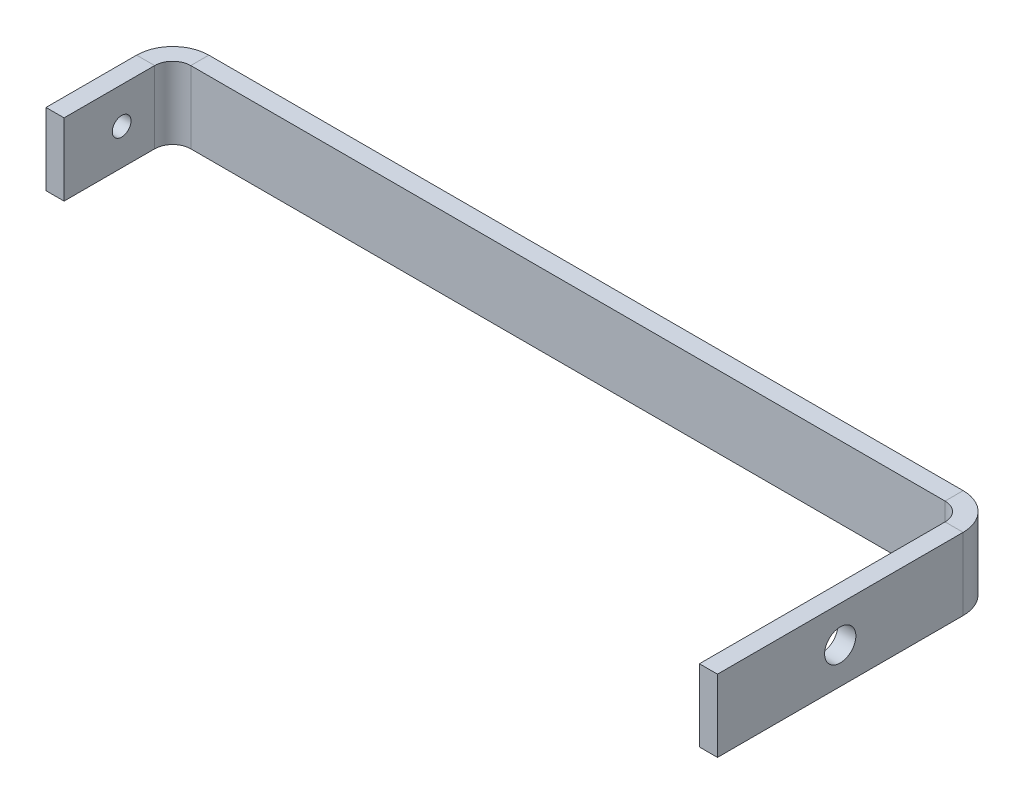
ISO-10303-21;
HEADER;
FILE_DESCRIPTION(('STEP AP214'),'2;1');
FILE_NAME('part.step','',(''),(''),'','','');
FILE_SCHEMA(('AUTOMOTIVE_DESIGN { 1 0 10303 214 1 1 1 1 }'));
ENDSEC;
DATA;
#1=APPLICATION_CONTEXT('core data for automotive mechanical design processes');
#2=APPLICATION_PROTOCOL_DEFINITION('international standard','automotive_design',2000,#1);
#3=PRODUCT_CONTEXT('',#1,'mechanical');
#4=PRODUCT('Part','Part','',(#3));
#5=PRODUCT_RELATED_PRODUCT_CATEGORY('part','',(#4));
#6=PRODUCT_DEFINITION_FORMATION('','',#4);
#7=PRODUCT_DEFINITION_CONTEXT('part definition',#1,'design');
#8=PRODUCT_DEFINITION('design','',#6,#7);
#9=PRODUCT_DEFINITION_SHAPE('','',#8);
#10=(LENGTH_UNIT() NAMED_UNIT(*) SI_UNIT(.MILLI.,.METRE.));
#11=(NAMED_UNIT(*) PLANE_ANGLE_UNIT() SI_UNIT($,.RADIAN.));
#12=(NAMED_UNIT(*) SI_UNIT($,.STERADIAN.) SOLID_ANGLE_UNIT());
#13=UNCERTAINTY_MEASURE_WITH_UNIT(LENGTH_MEASURE(1.E-05),#10,'distance_accuracy_value','');
#14=(GEOMETRIC_REPRESENTATION_CONTEXT(3) GLOBAL_UNCERTAINTY_ASSIGNED_CONTEXT((#13)) GLOBAL_UNIT_ASSIGNED_CONTEXT((#10,
#11,#12)) REPRESENTATION_CONTEXT('',''));
#15=CARTESIAN_POINT('',(0.,0.,0.));
#16=DIRECTION('',(0.,0.,1.));
#17=DIRECTION('',(1.,0.,0.));
#18=AXIS2_PLACEMENT_3D('',#15,#16,#17);
#19=CARTESIAN_POINT('',(0.,0.,-3.18));
#20=DIRECTION('',(0.,0.,-1.));
#21=DIRECTION('',(-1.,0.,0.));
#22=AXIS2_PLACEMENT_3D('',#19,#20,#21);
#23=PLANE('',#22);
#24=DIRECTION('',(1.,0.,0.));
#25=VECTOR('',#24,1.);
#26=CARTESIAN_POINT('',(103.5,-6.34999999999999,-3.18));
#27=LINE('',#26,#25);
#28=CARTESIAN_POINT('',(-80.0566,-6.35000000000001,-3.18));
#29=VERTEX_POINT('',#28);
#30=CARTESIAN_POINT('',(52.7536507605942,-6.34999999999999,-3.18));
#31=VERTEX_POINT('',#30);
#32=EDGE_CURVE('E50',#29,#31,#27,.T.);
#33=ORIENTED_EDGE('',*,*,#32,.F.);
#34=DIRECTION('',(0.,1.,0.));
#35=VECTOR('',#34,1.);
#36=CARTESIAN_POINT('',(-80.0566,0.,-3.18));
#37=LINE('',#36,#35);
#38=CARTESIAN_POINT('',(-80.0566,6.34999999999998,-3.18));
#39=VERTEX_POINT('',#38);
#40=EDGE_CURVE('E234',#29,#39,#37,.T.);
#41=ORIENTED_EDGE('',*,*,#40,.T.);
#42=DIRECTION('',(-1.,0.,0.));
#43=VECTOR('',#42,1.);
#44=CARTESIAN_POINT('',(103.5,6.35000000000001,-3.18));
#45=LINE('',#44,#43);
#46=CARTESIAN_POINT('',(52.7536507605942,6.35000000000001,-3.18));
#47=VERTEX_POINT('',#46);
#48=EDGE_CURVE('E199',#47,#39,#45,.T.);
#49=ORIENTED_EDGE('',*,*,#48,.F.);
#50=DIRECTION('',(0.,-1.,0.));
#51=VECTOR('',#50,1.);
#52=CARTESIAN_POINT('',(52.7536507605942,0.,-3.18));
#53=LINE('',#52,#51);
#54=EDGE_CURVE('E205',#47,#31,#53,.T.);
#55=ORIENTED_EDGE('',*,*,#54,.T.);
#56=EDGE_LOOP('',(#33,#41,#49,#55));
#57=FACE_BOUND('',#56,.T.);
#58=ADVANCED_FACE('F46',(#57),#23,.T.);
#59=CARTESIAN_POINT('',(103.5,-6.34999999999999,-3.18));
#60=DIRECTION('',(0.,-1.,0.));
#61=DIRECTION('',(1.,0.,0.));
#62=AXIS2_PLACEMENT_3D('',#59,#60,#61);
#63=PLANE('',#62);
#64=DIRECTION('',(1.,0.,0.));
#65=VECTOR('',#64,1.);
#66=CARTESIAN_POINT('',(103.5,-6.34999999999999,0.));
#67=LINE('',#66,#65);
#68=CARTESIAN_POINT('',(-80.0566,-6.35000000000001,0.));
#69=VERTEX_POINT('',#68);
#70=CARTESIAN_POINT('',(52.7536507605942,-6.35,0.));
#71=VERTEX_POINT('',#70);
#72=EDGE_CURVE('E200',#69,#71,#67,.T.);
#73=ORIENTED_EDGE('',*,*,#72,.F.);
#74=DIRECTION('',(0.,0.,-1.));
#75=VECTOR('',#74,1.);
#76=CARTESIAN_POINT('',(-80.0566,-6.35000000000001,-3.18));
#77=LINE('',#76,#75);
#78=EDGE_CURVE('E242',#69,#29,#77,.T.);
#79=ORIENTED_EDGE('',*,*,#78,.T.);
#80=ORIENTED_EDGE('',*,*,#32,.T.);
#81=DIRECTION('',(0.,0.,1.));
#82=VECTOR('',#81,1.);
#83=CARTESIAN_POINT('',(52.7536507605942,-6.35,-3.18));
#84=LINE('',#83,#82);
#85=EDGE_CURVE('E201',#31,#71,#84,.T.);
#86=ORIENTED_EDGE('',*,*,#85,.T.);
#87=EDGE_LOOP('',(#73,#79,#80,#86));
#88=FACE_BOUND('',#87,.T.);
#89=ADVANCED_FACE('F265',(#88),#63,.T.);
#90=CARTESIAN_POINT('',(103.5,6.35000000000001,-3.18));
#91=DIRECTION('',(0.,1.,0.));
#92=DIRECTION('',(-1.,0.,0.));
#93=AXIS2_PLACEMENT_3D('',#90,#91,#92);
#94=PLANE('',#93);
#95=ORIENTED_EDGE('',*,*,#48,.T.);
#96=DIRECTION('',(0.,0.,1.));
#97=VECTOR('',#96,1.);
#98=CARTESIAN_POINT('',(-80.0565999999999,6.34999999999999,-3.18));
#99=LINE('',#98,#97);
#100=CARTESIAN_POINT('',(-80.0566,6.34999999999999,0.));
#101=VERTEX_POINT('',#100);
#102=EDGE_CURVE('E12',#39,#101,#99,.T.);
#103=ORIENTED_EDGE('',*,*,#102,.T.);
#104=DIRECTION('',(-1.,0.,0.));
#105=VECTOR('',#104,1.);
#106=CARTESIAN_POINT('',(103.5,6.35000000000001,0.));
#107=LINE('',#106,#105);
#108=CARTESIAN_POINT('',(52.7536507605942,6.35000000000001,0.));
#109=VERTEX_POINT('',#108);
#110=EDGE_CURVE('E204',#109,#101,#107,.T.);
#111=ORIENTED_EDGE('',*,*,#110,.F.);
#112=DIRECTION('',(0.,0.,-1.));
#113=VECTOR('',#112,1.);
#114=CARTESIAN_POINT('',(52.7536507605942,6.35,-3.18));
#115=LINE('',#114,#113);
#116=EDGE_CURVE('E196',#109,#47,#115,.T.);
#117=ORIENTED_EDGE('',*,*,#116,.T.);
#118=EDGE_LOOP('',(#95,#103,#111,#117));
#119=FACE_BOUND('',#118,.T.);
#120=ADVANCED_FACE('F48',(#119),#94,.T.);
#121=CARTESIAN_POINT('',(55.9336507605944,0.,-57.0663492394058));
#122=DIRECTION('',(1.,0.,0.));
#123=DIRECTION('',(0.,0.,-1.));
#124=AXIS2_PLACEMENT_3D('',#121,#122,#123);
#125=PLANE('',#124);
#126=CARTESIAN_POINT('',(55.9336507605941,1.05412561050315E-13,24.8199999999837));
#127=DIRECTION('',(1.,0.,0.));
#128=DIRECTION('',(0.,0.,-1.));
#129=AXIS2_PLACEMENT_3D('',#126,#127,#128);
#130=CIRCLE('',#129,2.74999999980536);
#131=CARTESIAN_POINT('',(55.9336507605941,1.05412561050315E-13,22.0700000001783));
#132=VERTEX_POINT('',#131);
#133=EDGE_CURVE('E173',#132,#132,#130,.T.);
#134=ORIENTED_EDGE('',*,*,#133,.T.);
#135=EDGE_LOOP('',(#134));
#136=FACE_BOUND('',#135,.T.);
#137=DIRECTION('',(0.,0.,-1.));
#138=VECTOR('',#137,1.);
#139=CARTESIAN_POINT('',(55.933650760594,6.35000000000006,46.4336507605942));
#140=LINE('',#139,#138);
#141=CARTESIAN_POINT('',(55.933650760594,6.35000000000006,46.4336507605942));
#142=VERTEX_POINT('',#141);
#143=CARTESIAN_POINT('',(55.9336507605942,6.35000000000001,3.18));
#144=VERTEX_POINT('',#143);
#145=EDGE_CURVE('E71',#142,#144,#140,.T.);
#146=ORIENTED_EDGE('',*,*,#145,.T.);
#147=DIRECTION('',(0.,-1.,0.));
#148=VECTOR('',#147,1.);
#149=CARTESIAN_POINT('',(55.9336507605942,0.,3.18));
#150=LINE('',#149,#148);
#151=CARTESIAN_POINT('',(55.9336507605942,-6.34999999999999,3.18000000000001));
#152=VERTEX_POINT('',#151);
#153=EDGE_CURVE('E229',#144,#152,#150,.T.);
#154=ORIENTED_EDGE('',*,*,#153,.T.);
#155=DIRECTION('',(0.,0.,1.));
#156=VECTOR('',#155,1.);
#157=CARTESIAN_POINT('',(55.933650760594,-6.34999999999994,46.4336507605942));
#158=LINE('',#157,#156);
#159=CARTESIAN_POINT('',(55.933650760594,-6.34999999999994,46.4336507605942));
#160=VERTEX_POINT('',#159);
#161=EDGE_CURVE('E217',#152,#160,#158,.T.);
#162=ORIENTED_EDGE('',*,*,#161,.T.);
#163=DIRECTION('',(0.,1.,0.));
#164=VECTOR('',#163,1.);
#165=CARTESIAN_POINT('',(55.933650760594,6.35000000000006,46.4336507605942));
#166=LINE('',#165,#164);
#167=EDGE_CURVE('E215',#160,#142,#166,.T.);
#168=ORIENTED_EDGE('',*,*,#167,.T.);
#169=EDGE_LOOP('',(#146,#154,#162,#168));
#170=FACE_BOUND('',#169,.T.);
#171=ADVANCED_FACE('F277',(#136,#170),#125,.F.);
#172=CARTESIAN_POINT('',(59.113650760594,6.35000000000006,46.4336507605942));
#173=DIRECTION('',(0.,1.,0.));
#174=DIRECTION('',(0.,0.,-1.));
#175=AXIS2_PLACEMENT_3D('',#172,#173,#174);
#176=PLANE('',#175);
#177=DIRECTION('',(1.,0.,0.));
#178=VECTOR('',#177,1.);
#179=CARTESIAN_POINT('',(59.1136507605942,6.35000000000001,3.18000000000002));
#180=LINE('',#179,#178);
#181=CARTESIAN_POINT('',(59.1136507605942,6.35000000000001,3.18000000000001));
#182=VERTEX_POINT('',#181);
#183=EDGE_CURVE('E231',#144,#182,#180,.T.);
#184=ORIENTED_EDGE('',*,*,#183,.F.);
#185=ORIENTED_EDGE('',*,*,#145,.F.);
#186=DIRECTION('',(-1.,0.,0.));
#187=VECTOR('',#186,1.);
#188=CARTESIAN_POINT('',(59.113650760594,6.35000000000006,46.4336507605942));
#189=LINE('',#188,#187);
#190=CARTESIAN_POINT('',(59.113650760594,6.35000000000006,46.4336507605942));
#191=VERTEX_POINT('',#190);
#192=EDGE_CURVE('E218',#191,#142,#189,.T.);
#193=ORIENTED_EDGE('',*,*,#192,.F.);
#194=DIRECTION('',(0.,0.,-1.));
#195=VECTOR('',#194,1.);
#196=CARTESIAN_POINT('',(59.113650760594,6.35000000000006,46.4336507605942));
#197=LINE('',#196,#195);
#198=EDGE_CURVE('E213',#191,#182,#197,.T.);
#199=ORIENTED_EDGE('',*,*,#198,.T.);
#200=EDGE_LOOP('',(#184,#185,#193,#199));
#201=FACE_BOUND('',#200,.T.);
#202=ADVANCED_FACE('F275',(#201),#176,.T.);
#203=CARTESIAN_POINT('',(59.113650760594,6.35000000000006,46.4336507605942));
#204=DIRECTION('',(0.,0.,1.));
#205=DIRECTION('',(1.,0.,0.));
#206=AXIS2_PLACEMENT_3D('',#203,#204,#205);
#207=PLANE('',#206);
#208=ORIENTED_EDGE('',*,*,#167,.F.);
#209=DIRECTION('',(-1.,0.,0.));
#210=VECTOR('',#209,1.);
#211=CARTESIAN_POINT('',(59.113650760594,-6.34999999999994,46.4336507605942));
#212=LINE('',#211,#210);
#213=CARTESIAN_POINT('',(59.113650760594,-6.34999999999994,46.4336507605942));
#214=VERTEX_POINT('',#213);
#215=EDGE_CURVE('E221',#214,#160,#212,.T.);
#216=ORIENTED_EDGE('',*,*,#215,.F.);
#217=DIRECTION('',(0.,1.,0.));
#218=VECTOR('',#217,1.);
#219=CARTESIAN_POINT('',(59.113650760594,6.35000000000006,46.4336507605942));
#220=LINE('',#219,#218);
#221=EDGE_CURVE('E210',#214,#191,#220,.T.);
#222=ORIENTED_EDGE('',*,*,#221,.T.);
#223=ORIENTED_EDGE('',*,*,#192,.T.);
#224=EDGE_LOOP('',(#208,#216,#222,#223));
#225=FACE_BOUND('',#224,.T.);
#226=ADVANCED_FACE('F285',(#225),#207,.T.);
#227=CARTESIAN_POINT('',(59.113650760594,-6.34999999999994,46.4336507605942));
#228=DIRECTION('',(0.,-1.,0.));
#229=DIRECTION('',(0.,0.,1.));
#230=AXIS2_PLACEMENT_3D('',#227,#228,#229);
#231=PLANE('',#230);
#232=DIRECTION('',(-1.,0.,0.));
#233=VECTOR('',#232,1.);
#234=CARTESIAN_POINT('',(59.1136507605942,-6.34999999999999,3.18000000000002));
#235=LINE('',#234,#233);
#236=CARTESIAN_POINT('',(59.1136507605942,-6.34999999999999,3.18000000000004));
#237=VERTEX_POINT('',#236);
#238=EDGE_CURVE('E226',#237,#152,#235,.T.);
#239=ORIENTED_EDGE('',*,*,#238,.F.);
#240=DIRECTION('',(0.,0.,1.));
#241=VECTOR('',#240,1.);
#242=CARTESIAN_POINT('',(59.113650760594,-6.34999999999994,46.4336507605942));
#243=LINE('',#242,#241);
#244=EDGE_CURVE('E214',#237,#214,#243,.T.);
#245=ORIENTED_EDGE('',*,*,#244,.T.);
#246=ORIENTED_EDGE('',*,*,#215,.T.);
#247=ORIENTED_EDGE('',*,*,#161,.F.);
#248=EDGE_LOOP('',(#239,#245,#246,#247));
#249=FACE_BOUND('',#248,.T.);
#250=ADVANCED_FACE('F281',(#249),#231,.T.);
#251=CARTESIAN_POINT('',(59.1136507605944,0.,-57.0663492394058));
#252=DIRECTION('',(1.,0.,0.));
#253=DIRECTION('',(0.,0.,-1.));
#254=AXIS2_PLACEMENT_3D('',#251,#252,#253);
#255=PLANE('',#254);
#256=CARTESIAN_POINT('',(59.1136507605941,1.01937650402374E-13,24.8199999999837));
#257=DIRECTION('',(1.,0.,0.));
#258=DIRECTION('',(0.,0.,-1.));
#259=AXIS2_PLACEMENT_3D('',#256,#257,#258);
#260=CIRCLE('',#259,2.74999999980536);
#261=CARTESIAN_POINT('',(59.1136507605941,1.01937650402374E-13,22.0700000001784));
#262=VERTEX_POINT('',#261);
#263=EDGE_CURVE('E316',#262,#262,#260,.T.);
#264=ORIENTED_EDGE('',*,*,#263,.F.);
#265=EDGE_LOOP('',(#264));
#266=FACE_BOUND('',#265,.T.);
#267=DIRECTION('',(0.,-1.,0.));
#268=VECTOR('',#267,1.);
#269=CARTESIAN_POINT('',(59.1136507605942,0.,3.18000000000002));
#270=LINE('',#269,#268);
#271=EDGE_CURVE('E220',#182,#237,#270,.T.);
#272=ORIENTED_EDGE('',*,*,#271,.F.);
#273=ORIENTED_EDGE('',*,*,#198,.F.);
#274=ORIENTED_EDGE('',*,*,#221,.F.);
#275=ORIENTED_EDGE('',*,*,#244,.F.);
#276=EDGE_LOOP('',(#272,#273,#274,#275));
#277=FACE_BOUND('',#276,.T.);
#278=ADVANCED_FACE('F287',(#266,#277),#255,.T.);
#279=CARTESIAN_POINT('',(0.,0.,0.));
#280=DIRECTION('',(0.,0.,-1.));
#281=DIRECTION('',(-1.,0.,0.));
#282=AXIS2_PLACEMENT_3D('',#279,#280,#281);
#283=PLANE('',#282);
#284=DIRECTION('',(0.,1.,0.));
#285=VECTOR('',#284,1.);
#286=CARTESIAN_POINT('',(-80.0566,0.,0.));
#287=LINE('',#286,#285);
#288=EDGE_CURVE('E55',#69,#101,#287,.T.);
#289=ORIENTED_EDGE('',*,*,#288,.F.);
#290=ORIENTED_EDGE('',*,*,#72,.T.);
#291=DIRECTION('',(0.,-1.,0.));
#292=VECTOR('',#291,1.);
#293=CARTESIAN_POINT('',(52.7536507605942,0.,0.));
#294=LINE('',#293,#292);
#295=EDGE_CURVE('E191',#109,#71,#294,.T.);
#296=ORIENTED_EDGE('',*,*,#295,.F.);
#297=ORIENTED_EDGE('',*,*,#110,.T.);
#298=EDGE_LOOP('',(#289,#290,#296,#297));
#299=FACE_BOUND('',#298,.T.);
#300=ADVANCED_FACE('F253',(#299),#283,.F.);
#301=CARTESIAN_POINT('',(52.7536507605942,6.35000000000002,3.18));
#302=DIRECTION('',(0.,1.,0.));
#303=DIRECTION('',(-1.,0.,0.));
#304=AXIS2_PLACEMENT_3D('',#301,#302,#303);
#305=PLANE('',#304);
#306=ORIENTED_EDGE('',*,*,#116,.F.);
#307=CARTESIAN_POINT('',(52.7536507605942,6.35000000000001,3.18));
#308=DIRECTION('',(0.,-1.,0.));
#309=DIRECTION('',(1.,0.,0.));
#310=AXIS2_PLACEMENT_3D('',#307,#308,#309);
#311=CIRCLE('',#310,3.18);
#312=EDGE_CURVE('E180',#109,#144,#311,.T.);
#313=ORIENTED_EDGE('',*,*,#312,.T.);
#314=ORIENTED_EDGE('',*,*,#183,.T.);
#315=CARTESIAN_POINT('',(52.7536507605942,6.35000000000002,3.18));
#316=DIRECTION('',(0.,-1.,0.));
#317=DIRECTION('',(-1.,0.,0.));
#318=AXIS2_PLACEMENT_3D('',#315,#316,#317);
#319=CIRCLE('',#318,6.36);
#320=EDGE_CURVE('E184',#47,#182,#319,.T.);
#321=ORIENTED_EDGE('',*,*,#320,.F.);
#322=EDGE_LOOP('',(#306,#313,#314,#321));
#323=FACE_BOUND('',#322,.T.);
#324=ADVANCED_FACE('F273',(#323),#305,.T.);
#325=CARTESIAN_POINT('',(52.7536507605942,-6.34999999999999,3.18));
#326=DIRECTION('',(0.,-1.,0.));
#327=DIRECTION('',(1.,0.,0.));
#328=AXIS2_PLACEMENT_3D('',#325,#326,#327);
#329=PLANE('',#328);
#330=CARTESIAN_POINT('',(52.7536507605942,-6.34999999999997,3.18));
#331=DIRECTION('',(0.,-1.,0.));
#332=DIRECTION('',(1.,0.,0.));
#333=AXIS2_PLACEMENT_3D('',#330,#331,#332);
#334=CIRCLE('',#333,3.18);
#335=EDGE_CURVE('E188',#152,#71,#334,.F.);
#336=ORIENTED_EDGE('',*,*,#335,.T.);
#337=ORIENTED_EDGE('',*,*,#85,.F.);
#338=CARTESIAN_POINT('',(52.7536507605942,-6.34999999999999,3.18));
#339=DIRECTION('',(0.,1.,0.));
#340=DIRECTION('',(1.,0.,0.));
#341=AXIS2_PLACEMENT_3D('',#338,#339,#340);
#342=CIRCLE('',#341,6.36);
#343=EDGE_CURVE('E187',#237,#31,#342,.T.);
#344=ORIENTED_EDGE('',*,*,#343,.F.);
#345=ORIENTED_EDGE('',*,*,#238,.T.);
#346=EDGE_LOOP('',(#336,#337,#344,#345));
#347=FACE_BOUND('',#346,.T.);
#348=ADVANCED_FACE('F258',(#347),#329,.T.);
#349=CARTESIAN_POINT('',(52.7536507605942,15.0845261938977,3.18));
#350=DIRECTION('',(0.,-1.,0.));
#351=DIRECTION('',(1.,0.,0.));
#352=AXIS2_PLACEMENT_3D('',#349,#350,#351);
#353=CYLINDRICAL_SURFACE('',#352,6.36);
#354=ORIENTED_EDGE('',*,*,#271,.T.);
#355=ORIENTED_EDGE('',*,*,#343,.T.);
#356=ORIENTED_EDGE('',*,*,#54,.F.);
#357=ORIENTED_EDGE('',*,*,#320,.T.);
#358=EDGE_LOOP('',(#354,#355,#356,#357));
#359=FACE_BOUND('',#358,.T.);
#360=ADVANCED_FACE('F271',(#359),#353,.T.);
#361=CARTESIAN_POINT('',(52.7536507605942,15.0845261938977,3.18));
#362=DIRECTION('',(0.,-1.,0.));
#363=DIRECTION('',(1.,0.,0.));
#364=AXIS2_PLACEMENT_3D('',#361,#362,#363);
#365=CYLINDRICAL_SURFACE('',#364,3.18);
#366=ORIENTED_EDGE('',*,*,#153,.F.);
#367=ORIENTED_EDGE('',*,*,#312,.F.);
#368=ORIENTED_EDGE('',*,*,#295,.T.);
#369=ORIENTED_EDGE('',*,*,#335,.F.);
#370=EDGE_LOOP('',(#366,#367,#368,#369));
#371=FACE_BOUND('',#370,.T.);
#372=ADVANCED_FACE('F263',(#371),#365,.F.);
#373=CARTESIAN_POINT('',(-80.0566,-6.35000000000002,3.18));
#374=DIRECTION('',(0.,-1.,0.));
#375=DIRECTION('',(0.,0.,-1.));
#376=AXIS2_PLACEMENT_3D('',#373,#374,#375);
#377=PLANE('',#376);
#378=ORIENTED_EDGE('',*,*,#78,.F.);
#379=CARTESIAN_POINT('',(-80.0566,-6.35000000000001,3.18));
#380=DIRECTION('',(0.,1.,0.));
#381=DIRECTION('',(-1.,0.,0.));
#382=AXIS2_PLACEMENT_3D('',#379,#380,#381);
#383=CIRCLE('',#382,3.18);
#384=CARTESIAN_POINT('',(-83.2366,-6.35000000000002,3.18000000000002));
#385=VERTEX_POINT('',#384);
#386=EDGE_CURVE('E156',#69,#385,#383,.T.);
#387=ORIENTED_EDGE('',*,*,#386,.T.);
#388=DIRECTION('',(-1.,0.,0.));
#389=VECTOR('',#388,1.);
#390=CARTESIAN_POINT('',(-86.4166,-6.35000000000001,3.18000000000003));
#391=LINE('',#390,#389);
#392=CARTESIAN_POINT('',(-86.4166,-6.35000000000001,3.18000000000003));
#393=VERTEX_POINT('',#392);
#394=EDGE_CURVE('E163',#385,#393,#391,.T.);
#395=ORIENTED_EDGE('',*,*,#394,.T.);
#396=CARTESIAN_POINT('',(-80.0566,-6.35000000000002,3.18));
#397=DIRECTION('',(0.,1.,0.));
#398=DIRECTION('',(0.,0.,-1.));
#399=AXIS2_PLACEMENT_3D('',#396,#397,#398);
#400=CIRCLE('',#399,6.36);
#401=EDGE_CURVE('E174',#29,#393,#400,.T.);
#402=ORIENTED_EDGE('',*,*,#401,.F.);
#403=EDGE_LOOP('',(#378,#387,#395,#402));
#404=FACE_BOUND('',#403,.T.);
#405=ADVANCED_FACE('F337',(#404),#377,.T.);
#406=CARTESIAN_POINT('',(-80.0565999999999,6.34999999999999,3.18));
#407=DIRECTION('',(0.,1.,0.));
#408=DIRECTION('',(-1.,0.,0.));
#409=AXIS2_PLACEMENT_3D('',#406,#407,#408);
#410=PLANE('',#409);
#411=CARTESIAN_POINT('',(-80.0565999999999,6.34999999999998,3.18));
#412=DIRECTION('',(0.,1.,0.));
#413=DIRECTION('',(-1.,0.,0.));
#414=AXIS2_PLACEMENT_3D('',#411,#412,#413);
#415=CIRCLE('',#414,3.18);
#416=CARTESIAN_POINT('',(-83.2366,6.34999999999998,3.18));
#417=VERTEX_POINT('',#416);
#418=EDGE_CURVE('E63',#417,#101,#415,.F.);
#419=ORIENTED_EDGE('',*,*,#418,.T.);
#420=ORIENTED_EDGE('',*,*,#102,.F.);
#421=CARTESIAN_POINT('',(-80.0565999999999,6.34999999999999,3.18));
#422=DIRECTION('',(0.,-1.,0.));
#423=DIRECTION('',(-1.,0.,0.));
#424=AXIS2_PLACEMENT_3D('',#421,#422,#423);
#425=CIRCLE('',#424,6.36);
#426=CARTESIAN_POINT('',(-86.4166,6.34999999999999,3.17999999999999));
#427=VERTEX_POINT('',#426);
#428=EDGE_CURVE('E177',#427,#39,#425,.T.);
#429=ORIENTED_EDGE('',*,*,#428,.F.);
#430=DIRECTION('',(1.,0.,0.));
#431=VECTOR('',#430,1.);
#432=CARTESIAN_POINT('',(-86.4166,6.34999999999999,3.18000000000002));
#433=LINE('',#432,#431);
#434=EDGE_CURVE('E145',#427,#417,#433,.T.);
#435=ORIENTED_EDGE('',*,*,#434,.T.);
#436=EDGE_LOOP('',(#419,#420,#429,#435));
#437=FACE_BOUND('',#436,.T.);
#438=ADVANCED_FACE('F342',(#437),#410,.T.);
#439=CARTESIAN_POINT('',(-80.0566,-15.0845261938977,3.18));
#440=DIRECTION('',(0.,1.,0.));
#441=DIRECTION('',(-1.,0.,0.));
#442=AXIS2_PLACEMENT_3D('',#439,#440,#441);
#443=CYLINDRICAL_SURFACE('',#442,6.36);
#444=DIRECTION('',(0.,1.,0.));
#445=VECTOR('',#444,1.);
#446=CARTESIAN_POINT('',(-86.4166,0.,3.18000000000003));
#447=LINE('',#446,#445);
#448=EDGE_CURVE('E171',#393,#427,#447,.T.);
#449=ORIENTED_EDGE('',*,*,#448,.T.);
#450=ORIENTED_EDGE('',*,*,#428,.T.);
#451=ORIENTED_EDGE('',*,*,#40,.F.);
#452=ORIENTED_EDGE('',*,*,#401,.T.);
#453=EDGE_LOOP('',(#449,#450,#451,#452));
#454=FACE_BOUND('',#453,.T.);
#455=ADVANCED_FACE('F340',(#454),#443,.T.);
#456=CARTESIAN_POINT('',(-80.0566,-15.0845261938977,3.18));
#457=DIRECTION('',(0.,1.,0.));
#458=DIRECTION('',(-1.,0.,0.));
#459=AXIS2_PLACEMENT_3D('',#456,#457,#458);
#460=CYLINDRICAL_SURFACE('',#459,3.18);
#461=DIRECTION('',(0.,1.,0.));
#462=VECTOR('',#461,1.);
#463=CARTESIAN_POINT('',(-83.2366,0.,3.18000000000002));
#464=LINE('',#463,#462);
#465=EDGE_CURVE('E326',#385,#417,#464,.T.);
#466=ORIENTED_EDGE('',*,*,#465,.F.);
#467=ORIENTED_EDGE('',*,*,#386,.F.);
#468=ORIENTED_EDGE('',*,*,#288,.T.);
#469=ORIENTED_EDGE('',*,*,#418,.F.);
#470=EDGE_LOOP('',(#466,#467,#468,#469));
#471=FACE_BOUND('',#470,.T.);
#472=ADVANCED_FACE('F344',(#471),#460,.F.);
#473=CARTESIAN_POINT('',(-86.4165999999999,6.34999999999997,19.1307015211884));
#474=DIRECTION('',(0.,0.,1.));
#475=DIRECTION('',(1.,0.,0.));
#476=AXIS2_PLACEMENT_3D('',#473,#474,#475);
#477=PLANE('',#476);
#478=DIRECTION('',(0.,-1.,0.));
#479=VECTOR('',#478,1.);
#480=CARTESIAN_POINT('',(-83.2365999999999,6.34999999999997,19.1307015211884));
#481=LINE('',#480,#479);
#482=CARTESIAN_POINT('',(-83.2365999999999,6.34999999999997,19.1307015211884));
#483=VERTEX_POINT('',#482);
#484=CARTESIAN_POINT('',(-83.2365999999999,-6.35000000000003,19.1307015211883));
#485=VERTEX_POINT('',#484);
#486=EDGE_CURVE('E149',#483,#485,#481,.T.);
#487=ORIENTED_EDGE('',*,*,#486,.F.);
#488=DIRECTION('',(1.,0.,0.));
#489=VECTOR('',#488,1.);
#490=CARTESIAN_POINT('',(-86.4165999999999,6.34999999999997,19.1307015211884));
#491=LINE('',#490,#489);
#492=CARTESIAN_POINT('',(-86.4165999999999,6.34999999999997,19.1307015211884));
#493=VERTEX_POINT('',#492);
#494=EDGE_CURVE('E143',#493,#483,#491,.T.);
#495=ORIENTED_EDGE('',*,*,#494,.F.);
#496=DIRECTION('',(0.,-1.,0.));
#497=VECTOR('',#496,1.);
#498=CARTESIAN_POINT('',(-86.4165999999999,6.34999999999997,19.1307015211884));
#499=LINE('',#498,#497);
#500=CARTESIAN_POINT('',(-86.4165999999999,-6.35000000000003,19.1307015211884));
#501=VERTEX_POINT('',#500);
#502=EDGE_CURVE('E154',#493,#501,#499,.T.);
#503=ORIENTED_EDGE('',*,*,#502,.T.);
#504=DIRECTION('',(1.,0.,0.));
#505=VECTOR('',#504,1.);
#506=CARTESIAN_POINT('',(-86.4165999999999,-6.35000000000003,19.1307015211884));
#507=LINE('',#506,#505);
#508=EDGE_CURVE('E162',#501,#485,#507,.T.);
#509=ORIENTED_EDGE('',*,*,#508,.T.);
#510=EDGE_LOOP('',(#487,#495,#503,#509));
#511=FACE_BOUND('',#510,.T.);
#512=ADVANCED_FACE('F153',(#511),#477,.T.);
#513=CARTESIAN_POINT('',(-86.4166000000003,0.,-84.3692984788116));
#514=DIRECTION('',(-1.,0.,0.));
#515=DIRECTION('',(0.,0.,1.));
#516=AXIS2_PLACEMENT_3D('',#513,#514,#515);
#517=PLANE('',#516);
#518=CARTESIAN_POINT('',(-86.4166,0.,8.99124280140603));
#519=DIRECTION('',(-1.,0.,0.));
#520=DIRECTION('',(0.,0.,1.));
#521=AXIS2_PLACEMENT_3D('',#518,#519,#520);
#522=CIRCLE('',#521,1.64999999998319);
#523=CARTESIAN_POINT('',(-86.4166,0.,10.6412428013892));
#524=VERTEX_POINT('',#523);
#525=EDGE_CURVE('E319',#524,#524,#522,.T.);
#526=ORIENTED_EDGE('',*,*,#525,.F.);
#527=EDGE_LOOP('',(#526));
#528=FACE_BOUND('',#527,.T.);
#529=ORIENTED_EDGE('',*,*,#448,.F.);
#530=DIRECTION('',(0.,0.,-1.));
#531=VECTOR('',#530,1.);
#532=CARTESIAN_POINT('',(-86.4166000000006,-6.34999999999978,-187.869298478812));
#533=LINE('',#532,#531);
#534=EDGE_CURVE('E161',#501,#393,#533,.T.);
#535=ORIENTED_EDGE('',*,*,#534,.F.);
#536=ORIENTED_EDGE('',*,*,#502,.F.);
#537=DIRECTION('',(0.,0.,1.));
#538=VECTOR('',#537,1.);
#539=CARTESIAN_POINT('',(-86.4166000000006,6.35000000000022,-187.869298478812));
#540=LINE('',#539,#538);
#541=EDGE_CURVE('E140',#427,#493,#540,.T.);
#542=ORIENTED_EDGE('',*,*,#541,.F.);
#543=EDGE_LOOP('',(#529,#535,#536,#542));
#544=FACE_BOUND('',#543,.T.);
#545=ADVANCED_FACE('F159',(#528,#544),#517,.T.);
#546=CARTESIAN_POINT('',(-86.4166000000006,-6.34999999999978,-187.869298478812));
#547=DIRECTION('',(0.,-1.,0.));
#548=DIRECTION('',(0.,0.,-1.));
#549=AXIS2_PLACEMENT_3D('',#546,#547,#548);
#550=PLANE('',#549);
#551=ORIENTED_EDGE('',*,*,#394,.F.);
#552=DIRECTION('',(0.,0.,-1.));
#553=VECTOR('',#552,1.);
#554=CARTESIAN_POINT('',(-83.2366000000006,-6.34999999999979,-187.869298478812));
#555=LINE('',#554,#553);
#556=EDGE_CURVE('E329',#485,#385,#555,.T.);
#557=ORIENTED_EDGE('',*,*,#556,.F.);
#558=ORIENTED_EDGE('',*,*,#508,.F.);
#559=ORIENTED_EDGE('',*,*,#534,.T.);
#560=EDGE_LOOP('',(#551,#557,#558,#559));
#561=FACE_BOUND('',#560,.T.);
#562=ADVANCED_FACE('F332',(#561),#550,.T.);
#563=CARTESIAN_POINT('',(-83.2366000000003,0.,-84.3692984788116));
#564=DIRECTION('',(-1.,0.,0.));
#565=DIRECTION('',(0.,0.,1.));
#566=AXIS2_PLACEMENT_3D('',#563,#564,#565);
#567=PLANE('',#566);
#568=CARTESIAN_POINT('',(-83.2366,0.,8.99124280140602));
#569=DIRECTION('',(1.,0.,0.));
#570=DIRECTION('',(0.,0.,-1.));
#571=AXIS2_PLACEMENT_3D('',#568,#569,#570);
#572=CIRCLE('',#571,1.64999999998319);
#573=CARTESIAN_POINT('',(-83.2366,0.,7.34124280142283));
#574=VERTEX_POINT('',#573);
#575=EDGE_CURVE('E575',#574,#574,#572,.T.);
#576=ORIENTED_EDGE('',*,*,#575,.F.);
#577=EDGE_LOOP('',(#576));
#578=FACE_BOUND('',#577,.T.);
#579=ORIENTED_EDGE('',*,*,#556,.T.);
#580=ORIENTED_EDGE('',*,*,#465,.T.);
#581=DIRECTION('',(0.,0.,1.));
#582=VECTOR('',#581,1.);
#583=CARTESIAN_POINT('',(-83.2366000000006,6.35000000000021,-187.869298478812));
#584=LINE('',#583,#582);
#585=EDGE_CURVE('E324',#417,#483,#584,.T.);
#586=ORIENTED_EDGE('',*,*,#585,.T.);
#587=ORIENTED_EDGE('',*,*,#486,.T.);
#588=EDGE_LOOP('',(#579,#580,#586,#587));
#589=FACE_BOUND('',#588,.T.);
#590=ADVANCED_FACE('F346',(#578,#589),#567,.F.);
#591=CARTESIAN_POINT('',(-86.4166000000006,6.35000000000022,-187.869298478812));
#592=DIRECTION('',(0.,1.,0.));
#593=DIRECTION('',(0.,0.,1.));
#594=AXIS2_PLACEMENT_3D('',#591,#592,#593);
#595=PLANE('',#594);
#596=ORIENTED_EDGE('',*,*,#434,.F.);
#597=ORIENTED_EDGE('',*,*,#541,.T.);
#598=ORIENTED_EDGE('',*,*,#494,.T.);
#599=ORIENTED_EDGE('',*,*,#585,.F.);
#600=EDGE_LOOP('',(#596,#597,#598,#599));
#601=FACE_BOUND('',#600,.T.);
#602=ADVANCED_FACE('F142',(#601),#595,.T.);
#603=CARTESIAN_POINT('',(49.1136507605941,1.12865042377031E-13,24.8199999999837));
#604=DIRECTION('',(1.,0.,0.));
#605=DIRECTION('',(0.,0.,-1.));
#606=AXIS2_PLACEMENT_3D('',#603,#604,#605);
#607=CYLINDRICAL_SURFACE('',#606,2.74999999980536);
#608=ORIENTED_EDGE('',*,*,#263,.T.);
#609=EDGE_LOOP('',(#608));
#610=FACE_BOUND('',#609,.T.);
#611=ORIENTED_EDGE('',*,*,#133,.F.);
#612=EDGE_LOOP('',(#611));
#613=FACE_BOUND('',#612,.T.);
#614=ADVANCED_FACE('F354',(#610,#613),#607,.F.);
#615=CARTESIAN_POINT('',(-93.2366,0.,8.99124280140605));
#616=DIRECTION('',(1.,0.,0.));
#617=DIRECTION('',(0.,0.,-1.));
#618=AXIS2_PLACEMENT_3D('',#615,#616,#617);
#619=CYLINDRICAL_SURFACE('',#618,1.64999999998319);
#620=ORIENTED_EDGE('',*,*,#525,.T.);
#621=EDGE_LOOP('',(#620));
#622=FACE_BOUND('',#621,.T.);
#623=ORIENTED_EDGE('',*,*,#575,.T.);
#624=EDGE_LOOP('',(#623));
#625=FACE_BOUND('',#624,.T.);
#626=ADVANCED_FACE('F511',(#622,#625),#619,.F.);
#627=CLOSED_SHELL('',(#58,#89,#120,#171,#202,#226,#250,#278,#300,#324,#348,#360,#372,#405,#438,
#455,#472,#512,#545,#562,#590,#602,#614,#626));
#628=MANIFOLD_SOLID_BREP('B2',#627);
#629=ADVANCED_BREP_SHAPE_REPRESENTATION('',(#18,#628),#14);
#630=SHAPE_DEFINITION_REPRESENTATION(#9,#629);
ENDSEC;
END-ISO-10303-21;
